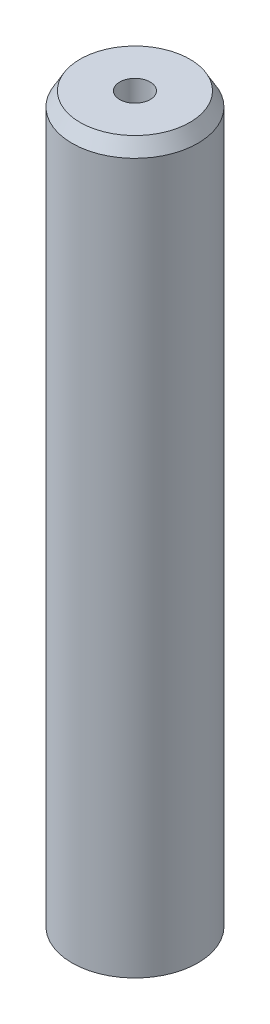
ISO-10303-21;
HEADER;
FILE_DESCRIPTION(('STEP AP214'),'2;1');
FILE_NAME('part.step','',(''),(''),'','','');
FILE_SCHEMA(('AUTOMOTIVE_DESIGN { 1 0 10303 214 1 1 1 1 }'));
ENDSEC;
DATA;
#1=APPLICATION_CONTEXT('core data for automotive mechanical design processes');
#2=APPLICATION_PROTOCOL_DEFINITION('international standard','automotive_design',2000,#1);
#3=PRODUCT_CONTEXT('',#1,'mechanical');
#4=PRODUCT('Part','Part','',(#3));
#5=PRODUCT_RELATED_PRODUCT_CATEGORY('part','',(#4));
#6=PRODUCT_DEFINITION_FORMATION('','',#4);
#7=PRODUCT_DEFINITION_CONTEXT('part definition',#1,'design');
#8=PRODUCT_DEFINITION('design','',#6,#7);
#9=PRODUCT_DEFINITION_SHAPE('','',#8);
#10=(LENGTH_UNIT() NAMED_UNIT(*) SI_UNIT(.MILLI.,.METRE.));
#11=(NAMED_UNIT(*) PLANE_ANGLE_UNIT() SI_UNIT($,.RADIAN.));
#12=(NAMED_UNIT(*) SI_UNIT($,.STERADIAN.) SOLID_ANGLE_UNIT());
#13=UNCERTAINTY_MEASURE_WITH_UNIT(LENGTH_MEASURE(1.E-05),#10,'distance_accuracy_value','');
#14=(GEOMETRIC_REPRESENTATION_CONTEXT(3) GLOBAL_UNCERTAINTY_ASSIGNED_CONTEXT((#13)) GLOBAL_UNIT_ASSIGNED_CONTEXT((#10,
#11,#12)) REPRESENTATION_CONTEXT('',''));
#15=CARTESIAN_POINT('',(0.,0.,0.));
#16=DIRECTION('',(0.,0.,1.));
#17=DIRECTION('',(1.,0.,0.));
#18=AXIS2_PLACEMENT_3D('',#15,#16,#17);
#19=CARTESIAN_POINT('',(0.,87.2146220530722,0.));
#20=DIRECTION('',(0.,-1.,0.));
#21=DIRECTION('',(0.,0.,-1.));
#22=AXIS2_PLACEMENT_3D('',#19,#20,#21);
#23=CYLINDRICAL_SURFACE('',#22,7.5);
#24=CARTESIAN_POINT('',(0.,85.5436026437409,0.));
#25=DIRECTION('',(0.,1.,0.));
#26=DIRECTION('',(0.,0.,1.));
#27=AXIS2_PLACEMENT_3D('',#24,#25,#26);
#28=CIRCLE('',#27,7.5);
#29=CARTESIAN_POINT('',(0.,85.5436026437409,7.5));
#30=VERTEX_POINT('',#29);
#31=EDGE_CURVE('E50',#30,#30,#28,.F.);
#32=ORIENTED_EDGE('',*,*,#31,.T.);
#33=EDGE_LOOP('',(#32));
#34=FACE_BOUND('',#33,.T.);
#35=CARTESIAN_POINT('',(0.,0.964763505798522,0.));
#36=DIRECTION('',(0.,1.,0.));
#37=DIRECTION('',(0.,0.,1.));
#38=AXIS2_PLACEMENT_3D('',#35,#36,#37);
#39=CIRCLE('',#38,7.5);
#40=CARTESIAN_POINT('',(0.,0.964763505798522,7.5));
#41=VERTEX_POINT('',#40);
#42=EDGE_CURVE('E51',#41,#41,#39,.T.);
#43=ORIENTED_EDGE('',*,*,#42,.T.);
#44=EDGE_LOOP('',(#43));
#45=FACE_BOUND('',#44,.T.);
#46=ADVANCED_FACE('F39',(#34,#45),#23,.T.);
#47=CARTESIAN_POINT('',(0.,87.2146220530722,0.));
#48=DIRECTION('',(0.,1.,0.));
#49=DIRECTION('',(0.,0.,1.));
#50=AXIS2_PLACEMENT_3D('',#47,#48,#49);
#51=PLANE('',#50);
#52=CARTESIAN_POINT('',(0.,87.2146220530722,0.));
#53=DIRECTION('',(0.,1.,0.));
#54=DIRECTION('',(0.,0.,1.));
#55=AXIS2_PLACEMENT_3D('',#52,#53,#54);
#56=CIRCLE('',#55,6.53523649420148);
#57=CARTESIAN_POINT('',(0.,87.2146220530722,6.53523649420148));
#58=VERTEX_POINT('',#57);
#59=EDGE_CURVE('E54',#58,#58,#56,.T.);
#60=ORIENTED_EDGE('',*,*,#59,.T.);
#61=EDGE_LOOP('',(#60));
#62=FACE_BOUND('',#61,.T.);
#63=CARTESIAN_POINT('',(0.,87.2146220530722,0.));
#64=DIRECTION('',(0.,1.,0.));
#65=DIRECTION('',(0.,0.,1.));
#66=AXIS2_PLACEMENT_3D('',#63,#64,#65);
#67=CIRCLE('',#66,1.81546971297105);
#68=CARTESIAN_POINT('',(0.,87.2146220530722,1.81546971297105));
#69=VERTEX_POINT('',#68);
#70=EDGE_CURVE('E58',#69,#69,#67,.T.);
#71=ORIENTED_EDGE('',*,*,#70,.F.);
#72=EDGE_LOOP('',(#71));
#73=FACE_BOUND('',#72,.T.);
#74=ADVANCED_FACE('F69',(#62,#73),#51,.T.);
#75=CARTESIAN_POINT('',(0.,0.,0.));
#76=DIRECTION('',(0.,1.,0.));
#77=DIRECTION('',(0.,0.,1.));
#78=AXIS2_PLACEMENT_3D('',#75,#76,#77);
#79=PLANE('',#78);
#80=CARTESIAN_POINT('',(0.,0.,0.));
#81=DIRECTION('',(0.,1.,0.));
#82=DIRECTION('',(0.,0.,1.));
#83=AXIS2_PLACEMENT_3D('',#80,#81,#82);
#84=CIRCLE('',#83,5.82898059066866);
#85=CARTESIAN_POINT('',(0.,0.,5.82898059066866));
#86=VERTEX_POINT('',#85);
#87=EDGE_CURVE('E10',#86,#86,#84,.F.);
#88=ORIENTED_EDGE('',*,*,#87,.T.);
#89=EDGE_LOOP('',(#88));
#90=FACE_BOUND('',#89,.T.);
#91=CARTESIAN_POINT('',(0.,0.,0.));
#92=DIRECTION('',(0.,1.,0.));
#93=DIRECTION('',(0.,0.,1.));
#94=AXIS2_PLACEMENT_3D('',#91,#92,#93);
#95=CIRCLE('',#94,1.81546971297105);
#96=CARTESIAN_POINT('',(0.,0.,1.81546971297105));
#97=VERTEX_POINT('',#96);
#98=EDGE_CURVE('E63',#97,#97,#95,.T.);
#99=ORIENTED_EDGE('',*,*,#98,.T.);
#100=EDGE_LOOP('',(#99));
#101=FACE_BOUND('',#100,.T.);
#102=ADVANCED_FACE('F75',(#90,#101),#79,.F.);
#103=CARTESIAN_POINT('',(0.,87.2146220530722,0.));
#104=DIRECTION('',(0.,-1.,0.));
#105=DIRECTION('',(0.,0.,-1.));
#106=AXIS2_PLACEMENT_3D('',#103,#104,#105);
#107=CYLINDRICAL_SURFACE('',#106,1.81546971297105);
#108=ORIENTED_EDGE('',*,*,#70,.T.);
#109=EDGE_LOOP('',(#108));
#110=FACE_BOUND('',#109,.T.);
#111=ORIENTED_EDGE('',*,*,#98,.F.);
#112=EDGE_LOOP('',(#111));
#113=FACE_BOUND('',#112,.T.);
#114=ADVANCED_FACE('F70',(#110,#113),#107,.F.);
#115=CARTESIAN_POINT('',(0.,87.2146220530722,0.));
#116=DIRECTION('',(0.,-1.,0.));
#117=DIRECTION('',(0.,0.,-1.));
#118=AXIS2_PLACEMENT_3D('',#115,#116,#117);
#119=CONICAL_SURFACE('',#118,6.53523649420148,0.523598775598294);
#120=ORIENTED_EDGE('',*,*,#31,.F.);
#121=EDGE_LOOP('',(#120));
#122=FACE_BOUND('',#121,.T.);
#123=ORIENTED_EDGE('',*,*,#59,.F.);
#124=EDGE_LOOP('',(#123));
#125=FACE_BOUND('',#124,.T.);
#126=ADVANCED_FACE('F81',(#122,#125),#119,.T.);
#127=CARTESIAN_POINT('',(0.,0.964763505798522,0.));
#128=DIRECTION('',(0.,1.,0.));
#129=DIRECTION('',(0.,0.,1.));
#130=AXIS2_PLACEMENT_3D('',#127,#128,#129);
#131=CONICAL_SURFACE('',#130,7.5,1.0471975511966);
#132=ORIENTED_EDGE('',*,*,#87,.F.);
#133=EDGE_LOOP('',(#132));
#134=FACE_BOUND('',#133,.T.);
#135=ORIENTED_EDGE('',*,*,#42,.F.);
#136=EDGE_LOOP('',(#135));
#137=FACE_BOUND('',#136,.T.);
#138=ADVANCED_FACE('F45',(#134,#137),#131,.T.);
#139=CLOSED_SHELL('',(#46,#74,#102,#114,#126,#138));
#140=MANIFOLD_SOLID_BREP('B2',#139);
#141=ADVANCED_BREP_SHAPE_REPRESENTATION('',(#18,#140),#14);
#142=SHAPE_DEFINITION_REPRESENTATION(#9,#141);
ENDSEC;
END-ISO-10303-21;
